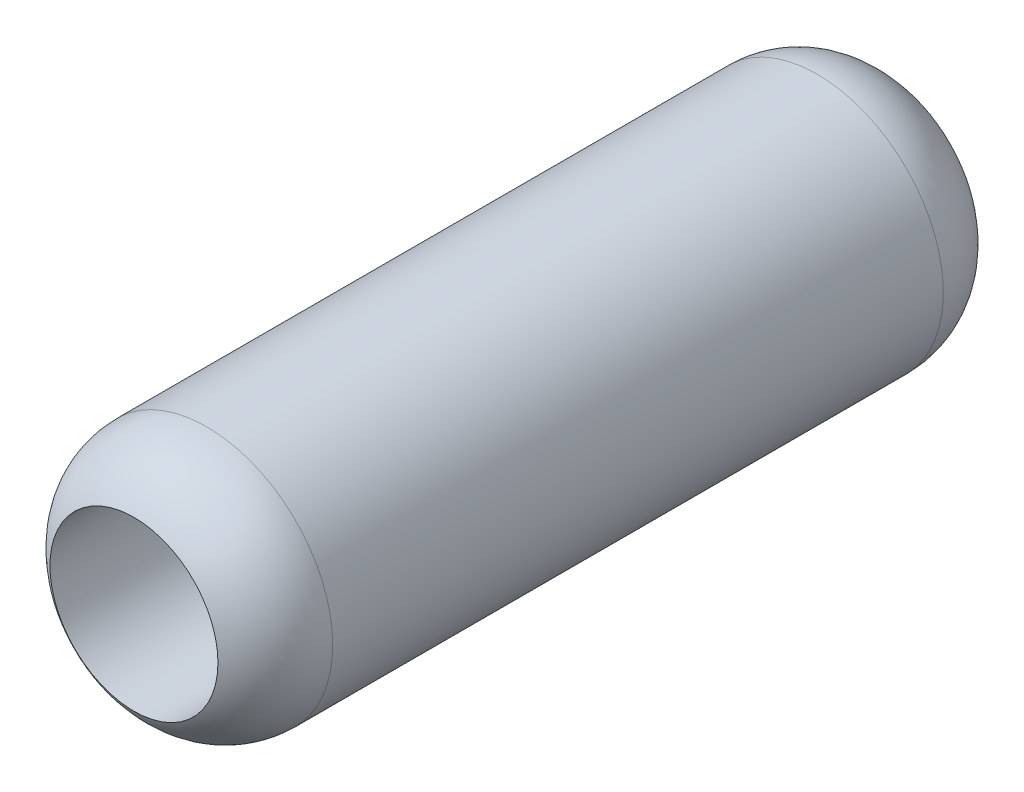
ISO-10303-21;
HEADER;
FILE_DESCRIPTION(('STEP AP214'),'2;1');
FILE_NAME('part.step','',(''),(''),'','','');
FILE_SCHEMA(('AUTOMOTIVE_DESIGN { 1 0 10303 214 1 1 1 1 }'));
ENDSEC;
DATA;
#1=APPLICATION_CONTEXT('core data for automotive mechanical design processes');
#2=APPLICATION_PROTOCOL_DEFINITION('international standard','automotive_design',2000,#1);
#3=PRODUCT_CONTEXT('',#1,'mechanical');
#4=PRODUCT('Part','Part','',(#3));
#5=PRODUCT_RELATED_PRODUCT_CATEGORY('part','',(#4));
#6=PRODUCT_DEFINITION_FORMATION('','',#4);
#7=PRODUCT_DEFINITION_CONTEXT('part definition',#1,'design');
#8=PRODUCT_DEFINITION('design','',#6,#7);
#9=PRODUCT_DEFINITION_SHAPE('','',#8);
#10=(LENGTH_UNIT() NAMED_UNIT(*) SI_UNIT(.MILLI.,.METRE.));
#11=(NAMED_UNIT(*) PLANE_ANGLE_UNIT() SI_UNIT($,.RADIAN.));
#12=(NAMED_UNIT(*) SI_UNIT($,.STERADIAN.) SOLID_ANGLE_UNIT());
#13=UNCERTAINTY_MEASURE_WITH_UNIT(LENGTH_MEASURE(1.E-05),#10,'distance_accuracy_value','');
#14=(GEOMETRIC_REPRESENTATION_CONTEXT(3) GLOBAL_UNCERTAINTY_ASSIGNED_CONTEXT((#13)) GLOBAL_UNIT_ASSIGNED_CONTEXT((#10,
#11,#12)) REPRESENTATION_CONTEXT('',''));
#15=CARTESIAN_POINT('',(0.,0.,0.));
#16=DIRECTION('',(0.,0.,1.));
#17=DIRECTION('',(1.,0.,0.));
#18=AXIS2_PLACEMENT_3D('',#15,#16,#17);
#19=CARTESIAN_POINT('',(-0.00318308961856466,-0.00356435942815408,9.));
#20=DIRECTION('',(0.,0.,-1.));
#21=DIRECTION('',(-1.,0.,0.));
#22=AXIS2_PLACEMENT_3D('',#19,#20,#21);
#23=CYLINDRICAL_SURFACE('',#22,1.5);
#24=CARTESIAN_POINT('',(-0.00318308961856466,-0.00356435942815408,0.866025403784441));
#25=DIRECTION('',(0.,0.,-1.));
#26=DIRECTION('',(-1.,0.,0.));
#27=AXIS2_PLACEMENT_3D('',#24,#25,#26);
#28=CIRCLE('',#27,1.5);
#29=CARTESIAN_POINT('',(-1.50318308961856,-0.00356435942815408,0.866025403784441));
#30=VERTEX_POINT('',#29);
#31=EDGE_CURVE('E10',#30,#30,#28,.F.);
#32=ORIENTED_EDGE('',*,*,#31,.T.);
#33=EDGE_LOOP('',(#32));
#34=FACE_BOUND('',#33,.T.);
#35=CARTESIAN_POINT('',(-0.00318308961856466,-0.00356435942815408,8.13397459621556));
#36=DIRECTION('',(0.,0.,1.));
#37=DIRECTION('',(1.,0.,0.));
#38=AXIS2_PLACEMENT_3D('',#35,#36,#37);
#39=CIRCLE('',#38,1.5);
#40=CARTESIAN_POINT('',(1.49681691038144,-0.00356435942815408,8.13397459621556));
#41=VERTEX_POINT('',#40);
#42=EDGE_CURVE('E44',#41,#41,#39,.F.);
#43=ORIENTED_EDGE('',*,*,#42,.T.);
#44=EDGE_LOOP('',(#43));
#45=FACE_BOUND('',#44,.T.);
#46=ADVANCED_FACE('F37',(#34,#45),#23,.T.);
#47=CARTESIAN_POINT('',(-0.00318308961856466,-0.00356435942815408,9.));
#48=DIRECTION('',(0.,0.,-1.));
#49=DIRECTION('',(-1.,0.,0.));
#50=AXIS2_PLACEMENT_3D('',#47,#48,#49);
#51=CYLINDRICAL_SURFACE('',#50,1.);
#52=CARTESIAN_POINT('',(-0.00318308961856466,-0.00356435942815408,9.));
#53=DIRECTION('',(0.,0.,1.));
#54=DIRECTION('',(1.,0.,0.));
#55=AXIS2_PLACEMENT_3D('',#52,#53,#54);
#56=CIRCLE('',#55,1.);
#57=CARTESIAN_POINT('',(0.996816910381435,-0.00356435942815408,9.));
#58=VERTEX_POINT('',#57);
#59=EDGE_CURVE('E48',#58,#58,#56,.T.);
#60=ORIENTED_EDGE('',*,*,#59,.T.);
#61=EDGE_LOOP('',(#60));
#62=FACE_BOUND('',#61,.T.);
#63=CARTESIAN_POINT('',(-0.00318308961856466,-0.00356435942815408,0.));
#64=DIRECTION('',(0.,0.,1.));
#65=DIRECTION('',(1.,0.,0.));
#66=AXIS2_PLACEMENT_3D('',#63,#64,#65);
#67=CIRCLE('',#66,1.);
#68=CARTESIAN_POINT('',(0.996816910381435,-0.00356435942815408,0.));
#69=VERTEX_POINT('',#68);
#70=EDGE_CURVE('E52',#69,#69,#67,.T.);
#71=ORIENTED_EDGE('',*,*,#70,.F.);
#72=EDGE_LOOP('',(#71));
#73=FACE_BOUND('',#72,.T.);
#74=ADVANCED_FACE('F61',(#62,#73),#51,.F.);
#75=CARTESIAN_POINT('',(-0.00318308961856466,-0.00356435942815408,0.866025403784438));
#76=DIRECTION('',(0.,0.,-1.));
#77=DIRECTION('',(-1.,0.,0.));
#78=AXIS2_PLACEMENT_3D('',#75,#76,#77);
#79=DEGENERATE_TOROIDAL_SURFACE('',#78,0.5,1.,.T.);
#80=ORIENTED_EDGE('',*,*,#70,.T.);
#81=EDGE_LOOP('',(#80));
#82=FACE_BOUND('',#81,.T.);
#83=ORIENTED_EDGE('',*,*,#31,.F.);
#84=EDGE_LOOP('',(#83));
#85=FACE_BOUND('',#84,.T.);
#86=ADVANCED_FACE('F58',(#82,#85),#79,.T.);
#87=CARTESIAN_POINT('',(-0.00318308961856466,-0.00356435942815408,8.13397459621556));
#88=DIRECTION('',(0.,0.,1.));
#89=DIRECTION('',(1.,0.,0.));
#90=AXIS2_PLACEMENT_3D('',#87,#88,#89);
#91=DEGENERATE_TOROIDAL_SURFACE('',#90,0.5,1.,.T.);
#92=ORIENTED_EDGE('',*,*,#42,.F.);
#93=EDGE_LOOP('',(#92));
#94=FACE_BOUND('',#93,.T.);
#95=ORIENTED_EDGE('',*,*,#59,.F.);
#96=EDGE_LOOP('',(#95));
#97=FACE_BOUND('',#96,.T.);
#98=ADVANCED_FACE('F39',(#94,#97),#91,.T.);
#99=CLOSED_SHELL('',(#46,#74,#86,#98));
#100=MANIFOLD_SOLID_BREP('B2',#99);
#101=ADVANCED_BREP_SHAPE_REPRESENTATION('',(#18,#100),#14);
#102=SHAPE_DEFINITION_REPRESENTATION(#9,#101);
ENDSEC;
END-ISO-10303-21;
